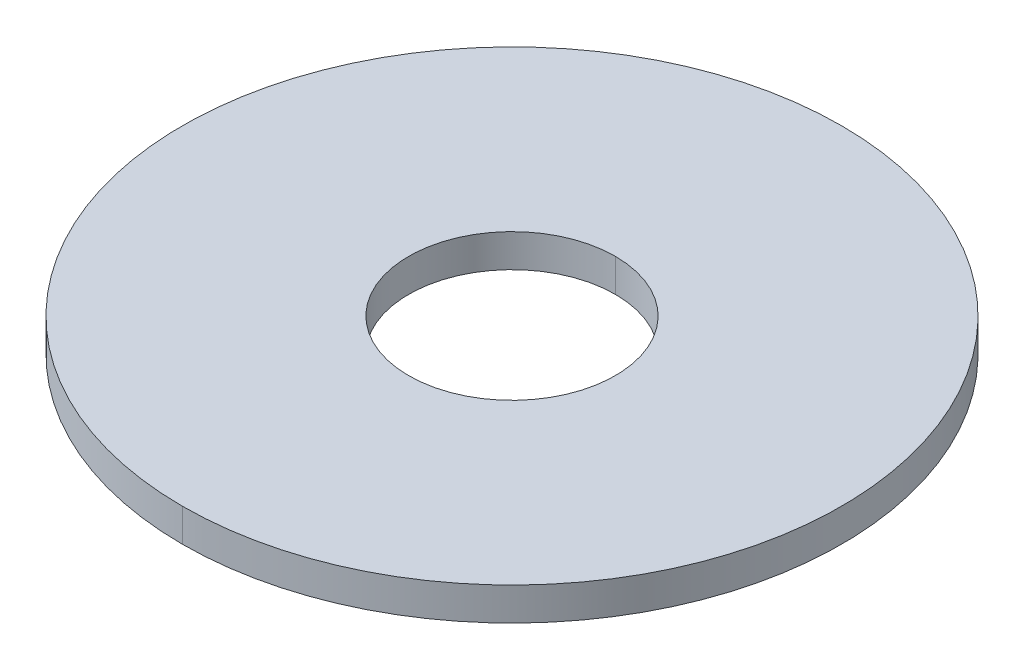
ISO-10303-21;
HEADER;
FILE_DESCRIPTION(('STEP AP214'),'2;1');
FILE_NAME('part.step','',(''),(''),'','','');
FILE_SCHEMA(('AUTOMOTIVE_DESIGN { 1 0 10303 214 1 1 1 1 }'));
ENDSEC;
DATA;
#1=APPLICATION_CONTEXT('core data for automotive mechanical design processes');
#2=APPLICATION_PROTOCOL_DEFINITION('international standard','automotive_design',2000,#1);
#3=PRODUCT_CONTEXT('',#1,'mechanical');
#4=PRODUCT('Part','Part','',(#3));
#5=PRODUCT_RELATED_PRODUCT_CATEGORY('part','',(#4));
#6=PRODUCT_DEFINITION_FORMATION('','',#4);
#7=PRODUCT_DEFINITION_CONTEXT('part definition',#1,'design');
#8=PRODUCT_DEFINITION('design','',#6,#7);
#9=PRODUCT_DEFINITION_SHAPE('','',#8);
#10=(LENGTH_UNIT() NAMED_UNIT(*) SI_UNIT(.MILLI.,.METRE.));
#11=(NAMED_UNIT(*) PLANE_ANGLE_UNIT() SI_UNIT($,.RADIAN.));
#12=(NAMED_UNIT(*) SI_UNIT($,.STERADIAN.) SOLID_ANGLE_UNIT());
#13=UNCERTAINTY_MEASURE_WITH_UNIT(LENGTH_MEASURE(1.E-05),#10,'distance_accuracy_value','');
#14=(GEOMETRIC_REPRESENTATION_CONTEXT(3) GLOBAL_UNCERTAINTY_ASSIGNED_CONTEXT((#13)) GLOBAL_UNIT_ASSIGNED_CONTEXT((#10,
#11,#12)) REPRESENTATION_CONTEXT('',''));
#15=CARTESIAN_POINT('',(0.,0.,0.));
#16=DIRECTION('',(0.,0.,1.));
#17=DIRECTION('',(1.,0.,0.));
#18=AXIS2_PLACEMENT_3D('',#15,#16,#17);
#19=CARTESIAN_POINT('',(0.,0.396875,0.));
#20=DIRECTION('',(0.,-1.,0.));
#21=DIRECTION('',(0.,0.,-1.));
#22=AXIS2_PLACEMENT_3D('',#19,#20,#21);
#23=CYLINDRICAL_SURFACE('',#22,2.4892);
#24=DIRECTION('',(0.,-1.,0.));
#25=VECTOR('',#24,1.);
#26=CARTESIAN_POINT('',(0.,0.396875,2.4892));
#27=LINE('',#26,#25);
#28=CARTESIAN_POINT('',(0.,0.396875,2.4892));
#29=VERTEX_POINT('',#28);
#30=CARTESIAN_POINT('',(0.,-0.396875,2.4892));
#31=VERTEX_POINT('',#30);
#32=EDGE_CURVE('E75',#29,#31,#27,.T.);
#33=ORIENTED_EDGE('',*,*,#32,.F.);
#34=CARTESIAN_POINT('',(0.,0.396875,0.));
#35=DIRECTION('',(0.,1.,0.));
#36=DIRECTION('',(0.,0.,1.));
#37=AXIS2_PLACEMENT_3D('',#34,#35,#36);
#38=CIRCLE('',#37,2.4892);
#39=CARTESIAN_POINT('',(0.,0.396875,-2.4892));
#40=VERTEX_POINT('',#39);
#41=EDGE_CURVE('E63',#29,#40,#38,.T.);
#42=ORIENTED_EDGE('',*,*,#41,.T.);
#43=DIRECTION('',(0.,-1.,0.));
#44=VECTOR('',#43,1.);
#45=CARTESIAN_POINT('',(0.,0.396875,-2.4892));
#46=LINE('',#45,#44);
#47=CARTESIAN_POINT('',(0.,-0.396875,-2.4892));
#48=VERTEX_POINT('',#47);
#49=EDGE_CURVE('E83',#40,#48,#46,.T.);
#50=ORIENTED_EDGE('',*,*,#49,.T.);
#51=CARTESIAN_POINT('',(0.,-0.396875,0.));
#52=DIRECTION('',(0.,1.,0.));
#53=DIRECTION('',(0.,0.,1.));
#54=AXIS2_PLACEMENT_3D('',#51,#52,#53);
#55=CIRCLE('',#54,2.4892);
#56=EDGE_CURVE('E11',#31,#48,#55,.T.);
#57=ORIENTED_EDGE('',*,*,#56,.F.);
#58=EDGE_LOOP('',(#33,#42,#50,#57));
#59=FACE_BOUND('',#58,.T.);
#60=ADVANCED_FACE('F16',(#59),#23,.F.);
#61=CARTESIAN_POINT('',(0.,0.396875,0.));
#62=DIRECTION('',(0.,-1.,0.));
#63=DIRECTION('',(0.,0.,-1.));
#64=AXIS2_PLACEMENT_3D('',#61,#62,#63);
#65=CYLINDRICAL_SURFACE('',#64,7.9375);
#66=DIRECTION('',(0.,-1.,0.));
#67=VECTOR('',#66,1.);
#68=CARTESIAN_POINT('',(0.,0.396875,7.9375));
#69=LINE('',#68,#67);
#70=CARTESIAN_POINT('',(0.,0.396875,7.9375));
#71=VERTEX_POINT('',#70);
#72=CARTESIAN_POINT('',(0.,-0.396875,7.9375));
#73=VERTEX_POINT('',#72);
#74=EDGE_CURVE('E119',#71,#73,#69,.T.);
#75=ORIENTED_EDGE('',*,*,#74,.F.);
#76=CARTESIAN_POINT('',(0.,0.396875,0.));
#77=DIRECTION('',(0.,1.,0.));
#78=DIRECTION('',(0.,0.,1.));
#79=AXIS2_PLACEMENT_3D('',#76,#77,#78);
#80=CIRCLE('',#79,7.9375);
#81=CARTESIAN_POINT('',(0.,0.396875,-7.9375));
#82=VERTEX_POINT('',#81);
#83=EDGE_CURVE('E72',#82,#71,#80,.T.);
#84=ORIENTED_EDGE('',*,*,#83,.F.);
#85=DIRECTION('',(0.,-1.,0.));
#86=VECTOR('',#85,1.);
#87=CARTESIAN_POINT('',(0.,0.396875,-7.9375));
#88=LINE('',#87,#86);
#89=CARTESIAN_POINT('',(0.,-0.396875,-7.9375));
#90=VERTEX_POINT('',#89);
#91=EDGE_CURVE('E133',#82,#90,#88,.T.);
#92=ORIENTED_EDGE('',*,*,#91,.T.);
#93=CARTESIAN_POINT('',(0.,-0.396875,0.));
#94=DIRECTION('',(0.,1.,0.));
#95=DIRECTION('',(0.,0.,1.));
#96=AXIS2_PLACEMENT_3D('',#93,#94,#95);
#97=CIRCLE('',#96,7.9375);
#98=EDGE_CURVE('E27',#90,#73,#97,.T.);
#99=ORIENTED_EDGE('',*,*,#98,.T.);
#100=EDGE_LOOP('',(#75,#84,#92,#99));
#101=FACE_BOUND('',#100,.T.);
#102=ADVANCED_FACE('F199',(#101),#65,.T.);
#103=CARTESIAN_POINT('',(0.,-0.396875,0.));
#104=DIRECTION('',(0.,1.,0.));
#105=DIRECTION('',(1.,0.,0.));
#106=AXIS2_PLACEMENT_3D('',#103,#104,#105);
#107=PLANE('',#106);
#108=CARTESIAN_POINT('',(0.,-0.396875,0.));
#109=DIRECTION('',(0.,1.,0.));
#110=DIRECTION('',(0.,0.,1.));
#111=AXIS2_PLACEMENT_3D('',#108,#109,#110);
#112=CIRCLE('',#111,2.4892);
#113=EDGE_CURVE('E80',#48,#31,#112,.T.);
#114=ORIENTED_EDGE('',*,*,#113,.T.);
#115=ORIENTED_EDGE('',*,*,#56,.T.);
#116=EDGE_LOOP('',(#114,#115));
#117=FACE_BOUND('',#116,.T.);
#118=ORIENTED_EDGE('',*,*,#98,.F.);
#119=CARTESIAN_POINT('',(0.,-0.396875,0.));
#120=DIRECTION('',(0.,1.,0.));
#121=DIRECTION('',(0.,0.,1.));
#122=AXIS2_PLACEMENT_3D('',#119,#120,#121);
#123=CIRCLE('',#122,7.9375);
#124=EDGE_CURVE('E126',#73,#90,#123,.T.);
#125=ORIENTED_EDGE('',*,*,#124,.F.);
#126=EDGE_LOOP('',(#118,#125));
#127=FACE_BOUND('',#126,.T.);
#128=ADVANCED_FACE('F188',(#117,#127),#107,.F.);
#129=CARTESIAN_POINT('',(0.,0.396875,0.));
#130=DIRECTION('',(0.,1.,0.));
#131=DIRECTION('',(1.,0.,0.));
#132=AXIS2_PLACEMENT_3D('',#129,#130,#131);
#133=PLANE('',#132);
#134=CARTESIAN_POINT('',(0.,0.396875,0.));
#135=DIRECTION('',(0.,1.,0.));
#136=DIRECTION('',(0.,0.,1.));
#137=AXIS2_PLACEMENT_3D('',#134,#135,#136);
#138=CIRCLE('',#137,2.4892);
#139=EDGE_CURVE('E20',#40,#29,#138,.T.);
#140=ORIENTED_EDGE('',*,*,#139,.F.);
#141=ORIENTED_EDGE('',*,*,#41,.F.);
#142=EDGE_LOOP('',(#140,#141));
#143=FACE_BOUND('',#142,.T.);
#144=ORIENTED_EDGE('',*,*,#83,.T.);
#145=CARTESIAN_POINT('',(0.,0.396875,0.));
#146=DIRECTION('',(0.,1.,0.));
#147=DIRECTION('',(0.,0.,1.));
#148=AXIS2_PLACEMENT_3D('',#145,#146,#147);
#149=CIRCLE('',#148,7.9375);
#150=EDGE_CURVE('E110',#71,#82,#149,.T.);
#151=ORIENTED_EDGE('',*,*,#150,.T.);
#152=EDGE_LOOP('',(#144,#151));
#153=FACE_BOUND('',#152,.T.);
#154=ADVANCED_FACE('F65',(#143,#153),#133,.T.);
#155=CARTESIAN_POINT('',(0.,0.396875,0.));
#156=DIRECTION('',(0.,-1.,0.));
#157=DIRECTION('',(0.,0.,-1.));
#158=AXIS2_PLACEMENT_3D('',#155,#156,#157);
#159=CYLINDRICAL_SURFACE('',#158,7.9375);
#160=ORIENTED_EDGE('',*,*,#150,.F.);
#161=ORIENTED_EDGE('',*,*,#74,.T.);
#162=ORIENTED_EDGE('',*,*,#124,.T.);
#163=ORIENTED_EDGE('',*,*,#91,.F.);
#164=EDGE_LOOP('',(#160,#161,#162,#163));
#165=FACE_BOUND('',#164,.T.);
#166=ADVANCED_FACE('F18',(#165),#159,.T.);
#167=CARTESIAN_POINT('',(0.,0.396875,0.));
#168=DIRECTION('',(0.,-1.,0.));
#169=DIRECTION('',(0.,0.,-1.));
#170=AXIS2_PLACEMENT_3D('',#167,#168,#169);
#171=CYLINDRICAL_SURFACE('',#170,2.4892);
#172=ORIENTED_EDGE('',*,*,#139,.T.);
#173=ORIENTED_EDGE('',*,*,#32,.T.);
#174=ORIENTED_EDGE('',*,*,#113,.F.);
#175=ORIENTED_EDGE('',*,*,#49,.F.);
#176=EDGE_LOOP('',(#172,#173,#174,#175));
#177=FACE_BOUND('',#176,.T.);
#178=ADVANCED_FACE('F82',(#177),#171,.F.);
#179=CLOSED_SHELL('',(#60,#102,#128,#154,#166,#178));
#180=MANIFOLD_SOLID_BREP('B1',#179);
#181=ADVANCED_BREP_SHAPE_REPRESENTATION('',(#18,#180),#14);
#182=SHAPE_DEFINITION_REPRESENTATION(#9,#181);
ENDSEC;
END-ISO-10303-21;
